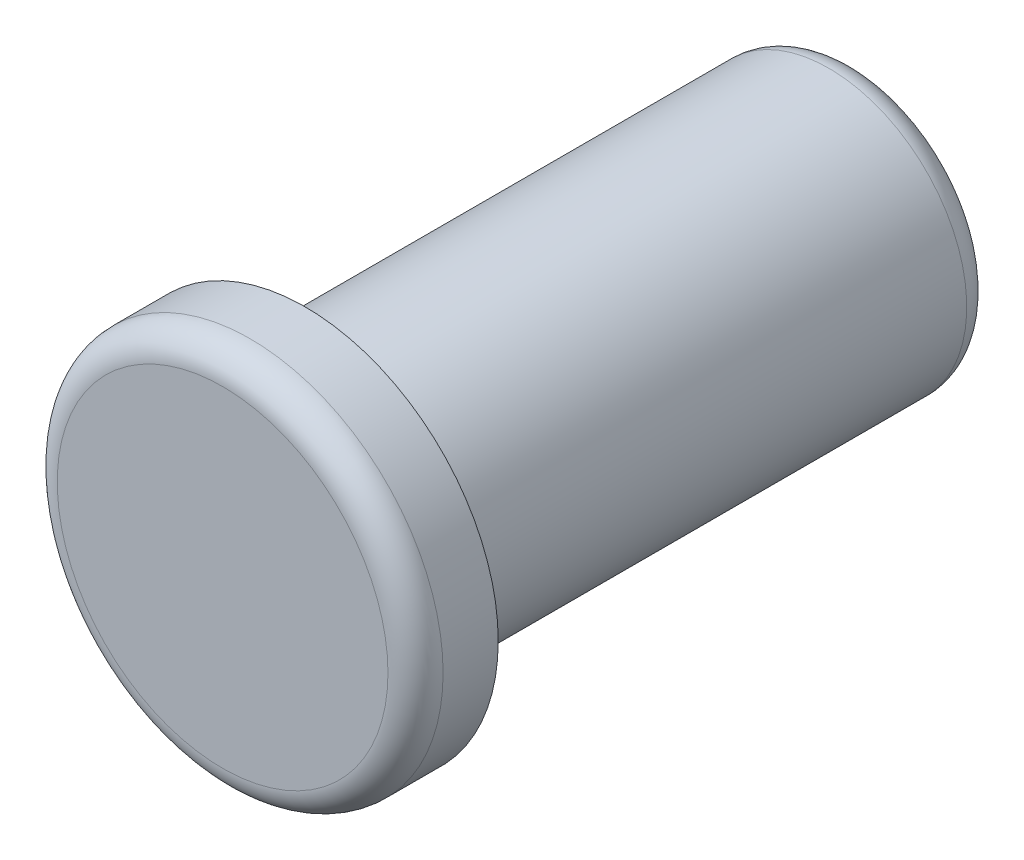
ISO-10303-21;
HEADER;
FILE_DESCRIPTION(('STEP AP214'),'2;1');
FILE_NAME('part.step','',(''),(''),'','','');
FILE_SCHEMA(('AUTOMOTIVE_DESIGN { 1 0 10303 214 1 1 1 1 }'));
ENDSEC;
DATA;
#1=APPLICATION_CONTEXT('core data for automotive mechanical design processes');
#2=APPLICATION_PROTOCOL_DEFINITION('international standard','automotive_design',2000,#1);
#3=PRODUCT_CONTEXT('',#1,'mechanical');
#4=PRODUCT('Part','Part','',(#3));
#5=PRODUCT_RELATED_PRODUCT_CATEGORY('part','',(#4));
#6=PRODUCT_DEFINITION_FORMATION('','',#4);
#7=PRODUCT_DEFINITION_CONTEXT('part definition',#1,'design');
#8=PRODUCT_DEFINITION('design','',#6,#7);
#9=PRODUCT_DEFINITION_SHAPE('','',#8);
#10=(LENGTH_UNIT() NAMED_UNIT(*) SI_UNIT(.MILLI.,.METRE.));
#11=(NAMED_UNIT(*) PLANE_ANGLE_UNIT() SI_UNIT($,.RADIAN.));
#12=(NAMED_UNIT(*) SI_UNIT($,.STERADIAN.) SOLID_ANGLE_UNIT());
#13=UNCERTAINTY_MEASURE_WITH_UNIT(LENGTH_MEASURE(1.E-05),#10,'distance_accuracy_value','');
#14=(GEOMETRIC_REPRESENTATION_CONTEXT(3) GLOBAL_UNCERTAINTY_ASSIGNED_CONTEXT((#13)) GLOBAL_UNIT_ASSIGNED_CONTEXT((#10,
#11,#12)) REPRESENTATION_CONTEXT('',''));
#15=CARTESIAN_POINT('',(0.,0.,0.));
#16=DIRECTION('',(0.,0.,1.));
#17=DIRECTION('',(1.,0.,0.));
#18=AXIS2_PLACEMENT_3D('',#15,#16,#17);
#19=CARTESIAN_POINT('',(0.,0.,3.));
#20=DIRECTION('',(0.,0.,-1.));
#21=DIRECTION('',(-1.,0.,0.));
#22=AXIS2_PLACEMENT_3D('',#19,#20,#21);
#23=CYLINDRICAL_SURFACE('',#22,7.);
#24=CARTESIAN_POINT('',(0.,0.,2.));
#25=DIRECTION('',(0.,0.,1.));
#26=DIRECTION('',(1.,0.,0.));
#27=AXIS2_PLACEMENT_3D('',#24,#25,#26);
#28=CIRCLE('',#27,7.);
#29=CARTESIAN_POINT('',(7.,0.,2.));
#30=VERTEX_POINT('',#29);
#31=EDGE_CURVE('E10',#30,#30,#28,.F.);
#32=ORIENTED_EDGE('',*,*,#31,.T.);
#33=EDGE_LOOP('',(#32));
#34=FACE_BOUND('',#33,.T.);
#35=CARTESIAN_POINT('',(0.,0.,0.));
#36=DIRECTION('',(0.,0.,1.));
#37=DIRECTION('',(1.,0.,0.));
#38=AXIS2_PLACEMENT_3D('',#35,#36,#37);
#39=CIRCLE('',#38,7.);
#40=CARTESIAN_POINT('',(7.,0.,0.));
#41=VERTEX_POINT('',#40);
#42=EDGE_CURVE('E54',#41,#41,#39,.T.);
#43=ORIENTED_EDGE('',*,*,#42,.T.);
#44=EDGE_LOOP('',(#43));
#45=FACE_BOUND('',#44,.T.);
#46=ADVANCED_FACE('F33',(#34,#45),#23,.T.);
#47=CARTESIAN_POINT('',(0.,0.,3.));
#48=DIRECTION('',(0.,0.,1.));
#49=DIRECTION('',(1.,0.,0.));
#50=AXIS2_PLACEMENT_3D('',#47,#48,#49);
#51=PLANE('',#50);
#52=CARTESIAN_POINT('',(0.,0.,3.));
#53=DIRECTION('',(0.,0.,1.));
#54=DIRECTION('',(1.,0.,0.));
#55=AXIS2_PLACEMENT_3D('',#52,#53,#54);
#56=CIRCLE('',#55,6.);
#57=CARTESIAN_POINT('',(6.,0.,3.));
#58=VERTEX_POINT('',#57);
#59=EDGE_CURVE('E40',#58,#58,#56,.T.);
#60=ORIENTED_EDGE('',*,*,#59,.T.);
#61=EDGE_LOOP('',(#60));
#62=FACE_BOUND('',#61,.T.);
#63=ADVANCED_FACE('F65',(#62),#51,.T.);
#64=CARTESIAN_POINT('',(0.,0.,0.));
#65=DIRECTION('',(0.,0.,1.));
#66=DIRECTION('',(1.,0.,0.));
#67=AXIS2_PLACEMENT_3D('',#64,#65,#66);
#68=PLANE('',#67);
#69=CARTESIAN_POINT('',(0.,0.,0.));
#70=DIRECTION('',(0.,0.,-1.));
#71=DIRECTION('',(-1.,0.,0.));
#72=AXIS2_PLACEMENT_3D('',#69,#70,#71);
#73=CIRCLE('',#72,5.);
#74=CARTESIAN_POINT('',(-5.,0.,0.));
#75=VERTEX_POINT('',#74);
#76=EDGE_CURVE('E53',#75,#75,#73,.T.);
#77=ORIENTED_EDGE('',*,*,#76,.F.);
#78=EDGE_LOOP('',(#77));
#79=FACE_BOUND('',#78,.T.);
#80=ORIENTED_EDGE('',*,*,#42,.F.);
#81=EDGE_LOOP('',(#80));
#82=FACE_BOUND('',#81,.T.);
#83=ADVANCED_FACE('F62',(#79,#82),#68,.F.);
#84=CARTESIAN_POINT('',(0.,0.,-20.));
#85=DIRECTION('',(0.,0.,1.));
#86=DIRECTION('',(1.,0.,0.));
#87=AXIS2_PLACEMENT_3D('',#84,#85,#86);
#88=CYLINDRICAL_SURFACE('',#87,5.);
#89=CARTESIAN_POINT('',(0.,0.,-19.));
#90=DIRECTION('',(0.,0.,-1.));
#91=DIRECTION('',(-1.,0.,0.));
#92=AXIS2_PLACEMENT_3D('',#89,#90,#91);
#93=CIRCLE('',#92,5.);
#94=CARTESIAN_POINT('',(-5.,0.,-19.));
#95=VERTEX_POINT('',#94);
#96=EDGE_CURVE('E44',#95,#95,#93,.F.);
#97=ORIENTED_EDGE('',*,*,#96,.T.);
#98=EDGE_LOOP('',(#97));
#99=FACE_BOUND('',#98,.T.);
#100=ORIENTED_EDGE('',*,*,#76,.T.);
#101=EDGE_LOOP('',(#100));
#102=FACE_BOUND('',#101,.T.);
#103=ADVANCED_FACE('F60',(#99,#102),#88,.T.);
#104=CARTESIAN_POINT('',(0.,0.,-20.));
#105=DIRECTION('',(0.,0.,-1.));
#106=DIRECTION('',(-1.,0.,0.));
#107=AXIS2_PLACEMENT_3D('',#104,#105,#106);
#108=PLANE('',#107);
#109=CARTESIAN_POINT('',(0.,0.,-20.));
#110=DIRECTION('',(0.,0.,-1.));
#111=DIRECTION('',(-1.,0.,0.));
#112=AXIS2_PLACEMENT_3D('',#109,#110,#111);
#113=CIRCLE('',#112,4.);
#114=CARTESIAN_POINT('',(-4.,0.,-20.));
#115=VERTEX_POINT('',#114);
#116=EDGE_CURVE('E48',#115,#115,#113,.T.);
#117=ORIENTED_EDGE('',*,*,#116,.T.);
#118=EDGE_LOOP('',(#117));
#119=FACE_BOUND('',#118,.T.);
#120=ADVANCED_FACE('F77',(#119),#108,.T.);
#121=CARTESIAN_POINT('',(0.,0.,-19.));
#122=DIRECTION('',(0.,0.,-1.));
#123=DIRECTION('',(-1.,0.,0.));
#124=AXIS2_PLACEMENT_3D('',#121,#122,#123);
#125=TOROIDAL_SURFACE('',#124,4.,1.);
#126=ORIENTED_EDGE('',*,*,#96,.F.);
#127=EDGE_LOOP('',(#126));
#128=FACE_BOUND('',#127,.T.);
#129=ORIENTED_EDGE('',*,*,#116,.F.);
#130=EDGE_LOOP('',(#129));
#131=FACE_BOUND('',#130,.T.);
#132=ADVANCED_FACE('F75',(#128,#131),#125,.T.);
#133=CARTESIAN_POINT('',(0.,0.,2.));
#134=DIRECTION('',(0.,0.,1.));
#135=DIRECTION('',(1.,0.,0.));
#136=AXIS2_PLACEMENT_3D('',#133,#134,#135);
#137=TOROIDAL_SURFACE('',#136,6.,1.);
#138=ORIENTED_EDGE('',*,*,#31,.F.);
#139=EDGE_LOOP('',(#138));
#140=FACE_BOUND('',#139,.T.);
#141=ORIENTED_EDGE('',*,*,#59,.F.);
#142=EDGE_LOOP('',(#141));
#143=FACE_BOUND('',#142,.T.);
#144=ADVANCED_FACE('F35',(#140,#143),#137,.T.);
#145=CLOSED_SHELL('',(#46,#63,#83,#103,#120,#132,#144));
#146=MANIFOLD_SOLID_BREP('B2',#145);
#147=ADVANCED_BREP_SHAPE_REPRESENTATION('',(#18,#146),#14);
#148=SHAPE_DEFINITION_REPRESENTATION(#9,#147);
ENDSEC;
END-ISO-10303-21;
